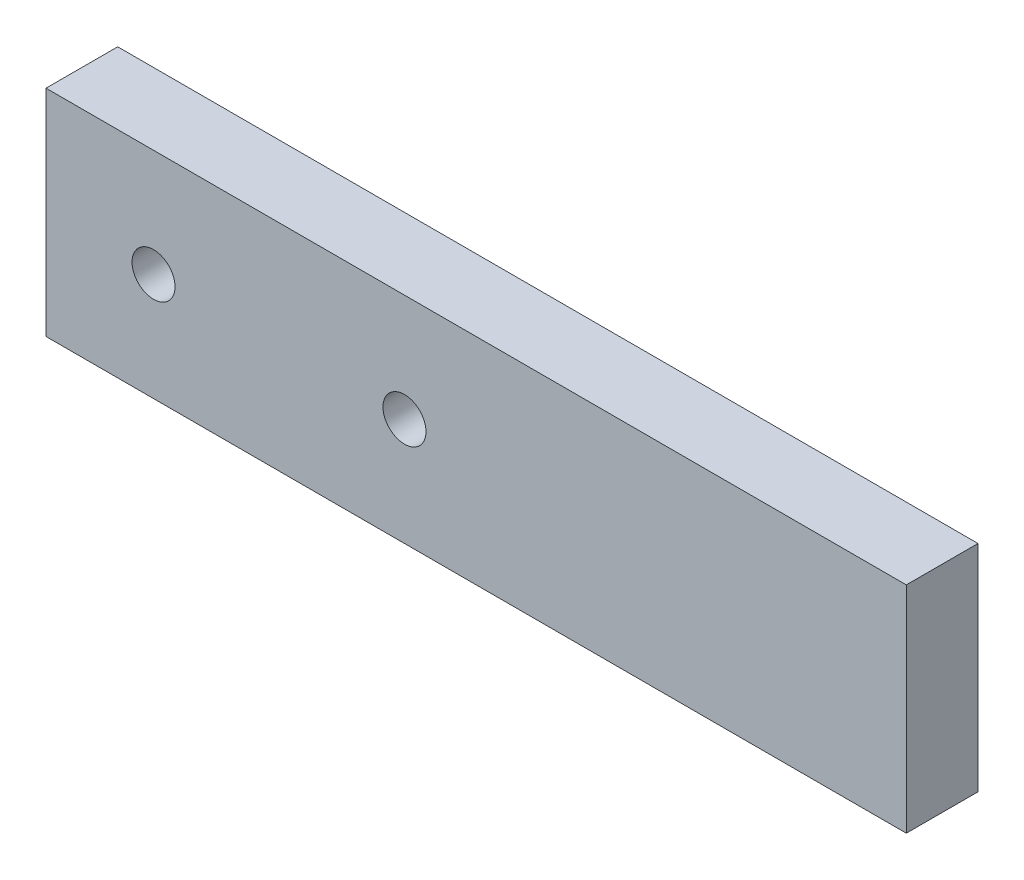
ISO-10303-21;
HEADER;
FILE_DESCRIPTION(('STEP AP214'),'2;1');
FILE_NAME('part.step','',(''),(''),'','','');
FILE_SCHEMA(('AUTOMOTIVE_DESIGN { 1 0 10303 214 1 1 1 1 }'));
ENDSEC;
DATA;
#1=APPLICATION_CONTEXT('core data for automotive mechanical design processes');
#2=APPLICATION_PROTOCOL_DEFINITION('international standard','automotive_design',2000,#1);
#3=PRODUCT_CONTEXT('',#1,'mechanical');
#4=PRODUCT('Part','Part','',(#3));
#5=PRODUCT_RELATED_PRODUCT_CATEGORY('part','',(#4));
#6=PRODUCT_DEFINITION_FORMATION('','',#4);
#7=PRODUCT_DEFINITION_CONTEXT('part definition',#1,'design');
#8=PRODUCT_DEFINITION('design','',#6,#7);
#9=PRODUCT_DEFINITION_SHAPE('','',#8);
#10=(LENGTH_UNIT() NAMED_UNIT(*) SI_UNIT(.MILLI.,.METRE.));
#11=(NAMED_UNIT(*) PLANE_ANGLE_UNIT() SI_UNIT($,.RADIAN.));
#12=(NAMED_UNIT(*) SI_UNIT($,.STERADIAN.) SOLID_ANGLE_UNIT());
#13=UNCERTAINTY_MEASURE_WITH_UNIT(LENGTH_MEASURE(1.E-05),#10,'distance_accuracy_value','');
#14=(GEOMETRIC_REPRESENTATION_CONTEXT(3) GLOBAL_UNCERTAINTY_ASSIGNED_CONTEXT((#13)) GLOBAL_UNIT_ASSIGNED_CONTEXT((#10,
#11,#12)) REPRESENTATION_CONTEXT('',''));
#15=CARTESIAN_POINT('',(0.,0.,0.));
#16=DIRECTION('',(0.,0.,1.));
#17=DIRECTION('',(1.,0.,0.));
#18=AXIS2_PLACEMENT_3D('',#15,#16,#17);
#19=CARTESIAN_POINT('',(0.,0.,5.));
#20=DIRECTION('',(0.,0.,1.));
#21=DIRECTION('',(1.,0.,0.));
#22=AXIS2_PLACEMENT_3D('',#19,#20,#21);
#23=PLANE('',#22);
#24=CARTESIAN_POINT('',(-52.5,7.5,5.));
#25=DIRECTION('',(0.,0.,1.));
#26=DIRECTION('',(1.,0.,0.));
#27=AXIS2_PLACEMENT_3D('',#24,#25,#26);
#28=CIRCLE('',#27,1.5);
#29=CARTESIAN_POINT('',(-51.,7.5,5.));
#30=VERTEX_POINT('',#29);
#31=EDGE_CURVE('E112',#30,#30,#28,.T.);
#32=ORIENTED_EDGE('',*,*,#31,.F.);
#33=EDGE_LOOP('',(#32));
#34=FACE_BOUND('',#33,.T.);
#35=DIRECTION('',(0.,1.,0.));
#36=VECTOR('',#35,1.);
#37=CARTESIAN_POINT('',(0.,0.,5.));
#38=LINE('',#37,#36);
#39=CARTESIAN_POINT('',(0.,0.,5.));
#40=VERTEX_POINT('',#39);
#41=CARTESIAN_POINT('',(0.,15.,5.));
#42=VERTEX_POINT('',#41);
#43=EDGE_CURVE('E92',#40,#42,#38,.T.);
#44=ORIENTED_EDGE('',*,*,#43,.T.);
#45=DIRECTION('',(-1.,0.,0.));
#46=VECTOR('',#45,1.);
#47=CARTESIAN_POINT('',(0.,15.,5.));
#48=LINE('',#47,#46);
#49=CARTESIAN_POINT('',(-60.,15.,5.));
#50=VERTEX_POINT('',#49);
#51=EDGE_CURVE('E87',#42,#50,#48,.T.);
#52=ORIENTED_EDGE('',*,*,#51,.T.);
#53=DIRECTION('',(0.,-1.,0.));
#54=VECTOR('',#53,1.);
#55=CARTESIAN_POINT('',(-60.,0.,5.));
#56=LINE('',#55,#54);
#57=CARTESIAN_POINT('',(-60.,0.,5.));
#58=VERTEX_POINT('',#57);
#59=EDGE_CURVE('E90',#50,#58,#56,.T.);
#60=ORIENTED_EDGE('',*,*,#59,.T.);
#61=DIRECTION('',(1.,0.,0.));
#62=VECTOR('',#61,1.);
#63=CARTESIAN_POINT('',(0.,0.,5.));
#64=LINE('',#63,#62);
#65=EDGE_CURVE('E57',#58,#40,#64,.T.);
#66=ORIENTED_EDGE('',*,*,#65,.T.);
#67=EDGE_LOOP('',(#44,#52,#60,#66));
#68=FACE_BOUND('',#67,.T.);
#69=CARTESIAN_POINT('',(-35.,7.5,5.));
#70=DIRECTION('',(0.,0.,1.));
#71=DIRECTION('',(1.,0.,0.));
#72=AXIS2_PLACEMENT_3D('',#69,#70,#71);
#73=CIRCLE('',#72,1.5);
#74=CARTESIAN_POINT('',(-33.5,7.5,5.));
#75=VERTEX_POINT('',#74);
#76=EDGE_CURVE('E134',#75,#75,#73,.T.);
#77=ORIENTED_EDGE('',*,*,#76,.F.);
#78=EDGE_LOOP('',(#77));
#79=FACE_BOUND('',#78,.T.);
#80=ADVANCED_FACE('F39',(#34,#68,#79),#23,.T.);
#81=CARTESIAN_POINT('',(0.,0.,0.));
#82=DIRECTION('',(0.,0.,1.));
#83=DIRECTION('',(1.,0.,0.));
#84=AXIS2_PLACEMENT_3D('',#81,#82,#83);
#85=PLANE('',#84);
#86=DIRECTION('',(0.,1.,0.));
#87=VECTOR('',#86,1.);
#88=CARTESIAN_POINT('',(0.,0.,0.));
#89=LINE('',#88,#87);
#90=CARTESIAN_POINT('',(0.,0.,0.));
#91=VERTEX_POINT('',#90);
#92=CARTESIAN_POINT('',(0.,15.,0.));
#93=VERTEX_POINT('',#92);
#94=EDGE_CURVE('E108',#91,#93,#89,.T.);
#95=ORIENTED_EDGE('',*,*,#94,.F.);
#96=DIRECTION('',(1.,0.,0.));
#97=VECTOR('',#96,1.);
#98=CARTESIAN_POINT('',(0.,0.,0.));
#99=LINE('',#98,#97);
#100=CARTESIAN_POINT('',(-60.,0.,0.));
#101=VERTEX_POINT('',#100);
#102=EDGE_CURVE('E80',#101,#91,#99,.T.);
#103=ORIENTED_EDGE('',*,*,#102,.F.);
#104=DIRECTION('',(0.,-1.,0.));
#105=VECTOR('',#104,1.);
#106=CARTESIAN_POINT('',(-60.,0.,0.));
#107=LINE('',#106,#105);
#108=CARTESIAN_POINT('',(-60.,15.,0.));
#109=VERTEX_POINT('',#108);
#110=EDGE_CURVE('E74',#109,#101,#107,.T.);
#111=ORIENTED_EDGE('',*,*,#110,.F.);
#112=DIRECTION('',(-1.,0.,0.));
#113=VECTOR('',#112,1.);
#114=CARTESIAN_POINT('',(0.,15.,0.));
#115=LINE('',#114,#113);
#116=EDGE_CURVE('E97',#93,#109,#115,.T.);
#117=ORIENTED_EDGE('',*,*,#116,.F.);
#118=EDGE_LOOP('',(#95,#103,#111,#117));
#119=FACE_BOUND('',#118,.T.);
#120=CARTESIAN_POINT('',(-52.5,7.5,0.));
#121=DIRECTION('',(0.,0.,1.));
#122=DIRECTION('',(1.,0.,0.));
#123=AXIS2_PLACEMENT_3D('',#120,#121,#122);
#124=CIRCLE('',#123,1.5);
#125=CARTESIAN_POINT('',(-51.,7.5,0.));
#126=VERTEX_POINT('',#125);
#127=EDGE_CURVE('E130',#126,#126,#124,.T.);
#128=ORIENTED_EDGE('',*,*,#127,.T.);
#129=EDGE_LOOP('',(#128));
#130=FACE_BOUND('',#129,.T.);
#131=CARTESIAN_POINT('',(-35.,7.5,0.));
#132=DIRECTION('',(0.,0.,1.));
#133=DIRECTION('',(1.,0.,0.));
#134=AXIS2_PLACEMENT_3D('',#131,#132,#133);
#135=CIRCLE('',#134,1.5);
#136=CARTESIAN_POINT('',(-33.5,7.5,0.));
#137=VERTEX_POINT('',#136);
#138=EDGE_CURVE('E138',#137,#137,#135,.T.);
#139=ORIENTED_EDGE('',*,*,#138,.T.);
#140=EDGE_LOOP('',(#139));
#141=FACE_BOUND('',#140,.T.);
#142=ADVANCED_FACE('F125',(#119,#130,#141),#85,.F.);
#143=CARTESIAN_POINT('',(0.,0.,5.));
#144=DIRECTION('',(-1.,0.,0.));
#145=DIRECTION('',(0.,-1.,0.));
#146=AXIS2_PLACEMENT_3D('',#143,#144,#145);
#147=PLANE('',#146);
#148=ORIENTED_EDGE('',*,*,#94,.T.);
#149=DIRECTION('',(0.,0.,-1.));
#150=VECTOR('',#149,1.);
#151=CARTESIAN_POINT('',(0.,15.,5.));
#152=LINE('',#151,#150);
#153=EDGE_CURVE('E11',#42,#93,#152,.T.);
#154=ORIENTED_EDGE('',*,*,#153,.F.);
#155=ORIENTED_EDGE('',*,*,#43,.F.);
#156=DIRECTION('',(0.,0.,-1.));
#157=VECTOR('',#156,1.);
#158=CARTESIAN_POINT('',(0.,0.,5.));
#159=LINE('',#158,#157);
#160=EDGE_CURVE('E104',#40,#91,#159,.T.);
#161=ORIENTED_EDGE('',*,*,#160,.T.);
#162=EDGE_LOOP('',(#148,#154,#155,#161));
#163=FACE_BOUND('',#162,.T.);
#164=ADVANCED_FACE('F41',(#163),#147,.F.);
#165=CARTESIAN_POINT('',(0.,15.,5.));
#166=DIRECTION('',(0.,-1.,0.));
#167=DIRECTION('',(1.,0.,0.));
#168=AXIS2_PLACEMENT_3D('',#165,#166,#167);
#169=PLANE('',#168);
#170=ORIENTED_EDGE('',*,*,#116,.T.);
#171=DIRECTION('',(0.,0.,-1.));
#172=VECTOR('',#171,1.);
#173=CARTESIAN_POINT('',(-60.,15.,5.));
#174=LINE('',#173,#172);
#175=EDGE_CURVE('E49',#50,#109,#174,.T.);
#176=ORIENTED_EDGE('',*,*,#175,.F.);
#177=ORIENTED_EDGE('',*,*,#51,.F.);
#178=ORIENTED_EDGE('',*,*,#153,.T.);
#179=EDGE_LOOP('',(#170,#176,#177,#178));
#180=FACE_BOUND('',#179,.T.);
#181=ADVANCED_FACE('F96',(#180),#169,.F.);
#182=CARTESIAN_POINT('',(-60.,0.,5.));
#183=DIRECTION('',(1.,0.,0.));
#184=DIRECTION('',(0.,0.,-1.));
#185=AXIS2_PLACEMENT_3D('',#182,#183,#184);
#186=PLANE('',#185);
#187=ORIENTED_EDGE('',*,*,#110,.T.);
#188=DIRECTION('',(0.,0.,-1.));
#189=VECTOR('',#188,1.);
#190=CARTESIAN_POINT('',(-60.,0.,5.));
#191=LINE('',#190,#189);
#192=EDGE_CURVE('E99',#58,#101,#191,.T.);
#193=ORIENTED_EDGE('',*,*,#192,.F.);
#194=ORIENTED_EDGE('',*,*,#59,.F.);
#195=ORIENTED_EDGE('',*,*,#175,.T.);
#196=EDGE_LOOP('',(#187,#193,#194,#195));
#197=FACE_BOUND('',#196,.T.);
#198=ADVANCED_FACE('F100',(#197),#186,.F.);
#199=CARTESIAN_POINT('',(0.,0.,5.));
#200=DIRECTION('',(0.,1.,0.));
#201=DIRECTION('',(0.,0.,1.));
#202=AXIS2_PLACEMENT_3D('',#199,#200,#201);
#203=PLANE('',#202);
#204=ORIENTED_EDGE('',*,*,#102,.T.);
#205=ORIENTED_EDGE('',*,*,#160,.F.);
#206=ORIENTED_EDGE('',*,*,#65,.F.);
#207=ORIENTED_EDGE('',*,*,#192,.T.);
#208=EDGE_LOOP('',(#204,#205,#206,#207));
#209=FACE_BOUND('',#208,.T.);
#210=ADVANCED_FACE('F122',(#209),#203,.F.);
#211=CARTESIAN_POINT('',(-52.5,7.5,5.));
#212=DIRECTION('',(0.,0.,-1.));
#213=DIRECTION('',(-1.,0.,0.));
#214=AXIS2_PLACEMENT_3D('',#211,#212,#213);
#215=CYLINDRICAL_SURFACE('',#214,1.5);
#216=ORIENTED_EDGE('',*,*,#31,.T.);
#217=EDGE_LOOP('',(#216));
#218=FACE_BOUND('',#217,.T.);
#219=ORIENTED_EDGE('',*,*,#127,.F.);
#220=EDGE_LOOP('',(#219));
#221=FACE_BOUND('',#220,.T.);
#222=ADVANCED_FACE('F157',(#218,#221),#215,.F.);
#223=CARTESIAN_POINT('',(-35.,7.5,5.));
#224=DIRECTION('',(0.,0.,-1.));
#225=DIRECTION('',(-1.,0.,0.));
#226=AXIS2_PLACEMENT_3D('',#223,#224,#225);
#227=CYLINDRICAL_SURFACE('',#226,1.5);
#228=ORIENTED_EDGE('',*,*,#76,.T.);
#229=EDGE_LOOP('',(#228));
#230=FACE_BOUND('',#229,.T.);
#231=ORIENTED_EDGE('',*,*,#138,.F.);
#232=EDGE_LOOP('',(#231));
#233=FACE_BOUND('',#232,.T.);
#234=ADVANCED_FACE('F146',(#230,#233),#227,.F.);
#235=CLOSED_SHELL('',(#80,#142,#164,#181,#198,#210,#222,#234));
#236=MANIFOLD_SOLID_BREP('B2',#235);
#237=ADVANCED_BREP_SHAPE_REPRESENTATION('',(#18,#236),#14);
#238=SHAPE_DEFINITION_REPRESENTATION(#9,#237);
ENDSEC;
END-ISO-10303-21;
